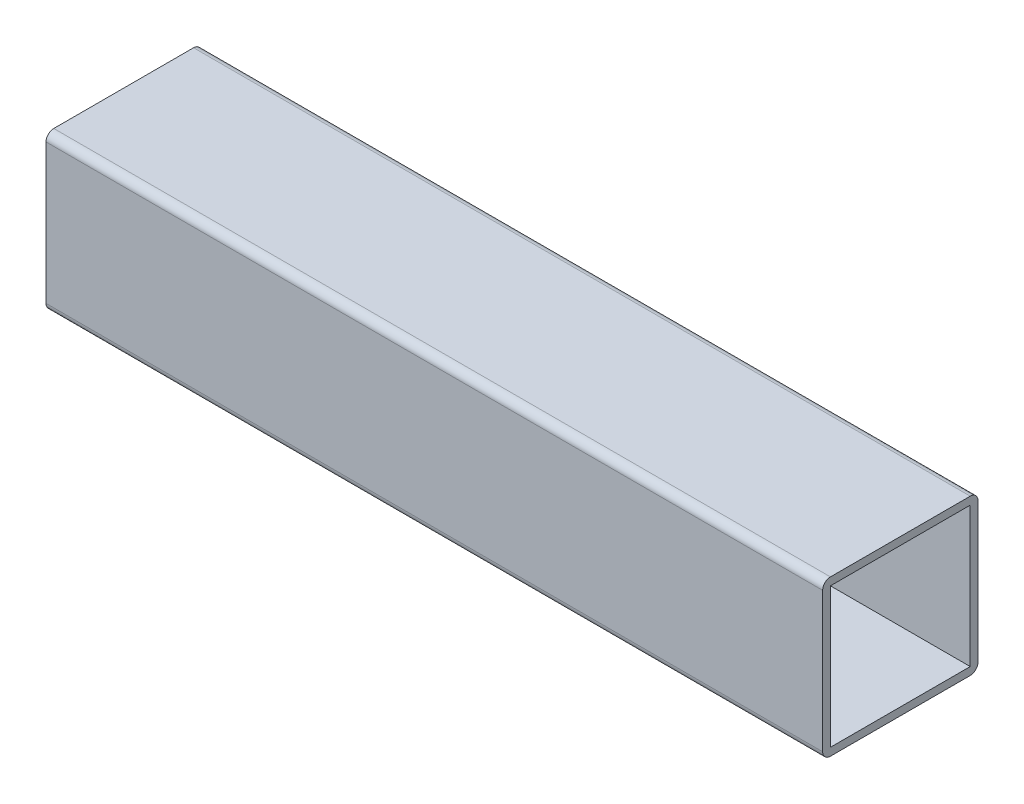
ISO-10303-21;
HEADER;
FILE_DESCRIPTION(('STEP AP214'),'2;1');
FILE_NAME('part.step','',(''),(''),'','','');
FILE_SCHEMA(('AUTOMOTIVE_DESIGN { 1 0 10303 214 1 1 1 1 }'));
ENDSEC;
DATA;
#1=APPLICATION_CONTEXT('core data for automotive mechanical design processes');
#2=APPLICATION_PROTOCOL_DEFINITION('international standard','automotive_design',2000,#1);
#3=PRODUCT_CONTEXT('',#1,'mechanical');
#4=PRODUCT('Part','Part','',(#3));
#5=PRODUCT_RELATED_PRODUCT_CATEGORY('part','',(#4));
#6=PRODUCT_DEFINITION_FORMATION('','',#4);
#7=PRODUCT_DEFINITION_CONTEXT('part definition',#1,'design');
#8=PRODUCT_DEFINITION('design','',#6,#7);
#9=PRODUCT_DEFINITION_SHAPE('','',#8);
#10=(LENGTH_UNIT() NAMED_UNIT(*) SI_UNIT(.MILLI.,.METRE.));
#11=(NAMED_UNIT(*) PLANE_ANGLE_UNIT() SI_UNIT($,.RADIAN.));
#12=(NAMED_UNIT(*) SI_UNIT($,.STERADIAN.) SOLID_ANGLE_UNIT());
#13=UNCERTAINTY_MEASURE_WITH_UNIT(LENGTH_MEASURE(1.E-05),#10,'distance_accuracy_value','');
#14=(GEOMETRIC_REPRESENTATION_CONTEXT(3) GLOBAL_UNCERTAINTY_ASSIGNED_CONTEXT((#13)) GLOBAL_UNIT_ASSIGNED_CONTEXT((#10,
#11,#12)) REPRESENTATION_CONTEXT('',''));
#15=CARTESIAN_POINT('',(0.,0.,0.));
#16=DIRECTION('',(0.,0.,1.));
#17=DIRECTION('',(1.,0.,0.));
#18=AXIS2_PLACEMENT_3D('',#15,#16,#17);
#19=CARTESIAN_POINT('',(300.,-27.,27.));
#20=DIRECTION('',(1.,0.,0.));
#21=DIRECTION('',(0.,0.,-1.));
#22=AXIS2_PLACEMENT_3D('',#19,#20,#21);
#23=PLANE('',#22);
#24=CARTESIAN_POINT('',(300.,-27.,27.));
#25=DIRECTION('',(1.,0.,0.));
#26=DIRECTION('',(0.,0.,-1.));
#27=AXIS2_PLACEMENT_3D('',#24,#25,#26);
#28=CIRCLE('',#27,3.);
#29=CARTESIAN_POINT('',(300.,-27.,30.));
#30=VERTEX_POINT('',#29);
#31=CARTESIAN_POINT('',(300.,-30.,27.));
#32=VERTEX_POINT('',#31);
#33=EDGE_CURVE('E213',#30,#32,#28,.T.);
#34=ORIENTED_EDGE('',*,*,#33,.T.);
#35=DIRECTION('',(0.,0.,-1.));
#36=VECTOR('',#35,1.);
#37=CARTESIAN_POINT('',(300.,-30.,27.));
#38=LINE('',#37,#36);
#39=CARTESIAN_POINT('',(300.,-30.,-27.));
#40=VERTEX_POINT('',#39);
#41=EDGE_CURVE('E217',#32,#40,#38,.T.);
#42=ORIENTED_EDGE('',*,*,#41,.T.);
#43=CARTESIAN_POINT('',(300.,-27.,-27.));
#44=DIRECTION('',(1.,0.,0.));
#45=DIRECTION('',(0.,0.,-1.));
#46=AXIS2_PLACEMENT_3D('',#43,#44,#45);
#47=CIRCLE('',#46,3.);
#48=CARTESIAN_POINT('',(300.,-27.,-30.));
#49=VERTEX_POINT('',#48);
#50=EDGE_CURVE('E221',#40,#49,#47,.T.);
#51=ORIENTED_EDGE('',*,*,#50,.T.);
#52=DIRECTION('',(0.,1.,0.));
#53=VECTOR('',#52,1.);
#54=CARTESIAN_POINT('',(300.,27.,-30.));
#55=LINE('',#54,#53);
#56=CARTESIAN_POINT('',(300.,27.,-30.));
#57=VERTEX_POINT('',#56);
#58=EDGE_CURVE('E224',#49,#57,#55,.T.);
#59=ORIENTED_EDGE('',*,*,#58,.T.);
#60=CARTESIAN_POINT('',(300.,27.,-27.));
#61=DIRECTION('',(1.,0.,0.));
#62=DIRECTION('',(0.,0.,1.));
#63=AXIS2_PLACEMENT_3D('',#60,#61,#62);
#64=CIRCLE('',#63,3.);
#65=CARTESIAN_POINT('',(300.,30.,-27.));
#66=VERTEX_POINT('',#65);
#67=EDGE_CURVE('E227',#57,#66,#64,.T.);
#68=ORIENTED_EDGE('',*,*,#67,.T.);
#69=DIRECTION('',(0.,0.,1.));
#70=VECTOR('',#69,1.);
#71=CARTESIAN_POINT('',(300.,30.,27.));
#72=LINE('',#71,#70);
#73=CARTESIAN_POINT('',(300.,30.,27.));
#74=VERTEX_POINT('',#73);
#75=EDGE_CURVE('E230',#66,#74,#72,.T.);
#76=ORIENTED_EDGE('',*,*,#75,.T.);
#77=CARTESIAN_POINT('',(300.,27.,27.));
#78=DIRECTION('',(1.,0.,0.));
#79=DIRECTION('',(0.,0.,-1.));
#80=AXIS2_PLACEMENT_3D('',#77,#78,#79);
#81=CIRCLE('',#80,3.);
#82=CARTESIAN_POINT('',(300.,27.,30.));
#83=VERTEX_POINT('',#82);
#84=EDGE_CURVE('E233',#74,#83,#81,.T.);
#85=ORIENTED_EDGE('',*,*,#84,.T.);
#86=DIRECTION('',(0.,-1.,0.));
#87=VECTOR('',#86,1.);
#88=CARTESIAN_POINT('',(300.,27.,30.));
#89=LINE('',#88,#87);
#90=EDGE_CURVE('E236',#83,#30,#89,.T.);
#91=ORIENTED_EDGE('',*,*,#90,.T.);
#92=EDGE_LOOP('',(#34,#42,#51,#59,#68,#76,#85,#91));
#93=FACE_BOUND('',#92,.T.);
#94=DIRECTION('',(0.,1.,0.));
#95=VECTOR('',#94,1.);
#96=CARTESIAN_POINT('',(300.,27.,-27.));
#97=LINE('',#96,#95);
#98=CARTESIAN_POINT('',(300.,-27.,-27.));
#99=VERTEX_POINT('',#98);
#100=CARTESIAN_POINT('',(300.,27.,-27.));
#101=VERTEX_POINT('',#100);
#102=EDGE_CURVE('E174',#99,#101,#97,.T.);
#103=ORIENTED_EDGE('',*,*,#102,.F.);
#104=DIRECTION('',(0.,0.,-1.));
#105=VECTOR('',#104,1.);
#106=CARTESIAN_POINT('',(300.,-27.,27.));
#107=LINE('',#106,#105);
#108=CARTESIAN_POINT('',(300.,-27.,27.));
#109=VERTEX_POINT('',#108);
#110=EDGE_CURVE('E165',#109,#99,#107,.T.);
#111=ORIENTED_EDGE('',*,*,#110,.F.);
#112=DIRECTION('',(0.,-1.,0.));
#113=VECTOR('',#112,1.);
#114=CARTESIAN_POINT('',(300.,27.,27.));
#115=LINE('',#114,#113);
#116=CARTESIAN_POINT('',(300.,27.,27.));
#117=VERTEX_POINT('',#116);
#118=EDGE_CURVE('E191',#117,#109,#115,.T.);
#119=ORIENTED_EDGE('',*,*,#118,.F.);
#120=DIRECTION('',(0.,0.,1.));
#121=VECTOR('',#120,1.);
#122=CARTESIAN_POINT('',(300.,27.,27.));
#123=LINE('',#122,#121);
#124=EDGE_CURVE('E187',#101,#117,#123,.T.);
#125=ORIENTED_EDGE('',*,*,#124,.F.);
#126=EDGE_LOOP('',(#103,#111,#119,#125));
#127=FACE_BOUND('',#126,.T.);
#128=ADVANCED_FACE('F75',(#93,#127),#23,.T.);
#129=CARTESIAN_POINT('',(0.,-27.,27.));
#130=DIRECTION('',(1.,0.,0.));
#131=DIRECTION('',(0.,0.,-1.));
#132=AXIS2_PLACEMENT_3D('',#129,#130,#131);
#133=PLANE('',#132);
#134=CARTESIAN_POINT('',(0.,-27.,27.));
#135=DIRECTION('',(1.,0.,0.));
#136=DIRECTION('',(0.,0.,-1.));
#137=AXIS2_PLACEMENT_3D('',#134,#135,#136);
#138=CIRCLE('',#137,3.);
#139=CARTESIAN_POINT('',(0.,-27.,30.));
#140=VERTEX_POINT('',#139);
#141=CARTESIAN_POINT('',(0.,-30.,27.));
#142=VERTEX_POINT('',#141);
#143=EDGE_CURVE('E183',#140,#142,#138,.T.);
#144=ORIENTED_EDGE('',*,*,#143,.F.);
#145=DIRECTION('',(0.,-1.,0.));
#146=VECTOR('',#145,1.);
#147=CARTESIAN_POINT('',(0.,27.,30.));
#148=LINE('',#147,#146);
#149=CARTESIAN_POINT('',(0.,27.,30.));
#150=VERTEX_POINT('',#149);
#151=EDGE_CURVE('E218',#150,#140,#148,.T.);
#152=ORIENTED_EDGE('',*,*,#151,.F.);
#153=CARTESIAN_POINT('',(0.,27.,27.));
#154=DIRECTION('',(1.,0.,0.));
#155=DIRECTION('',(0.,0.,-1.));
#156=AXIS2_PLACEMENT_3D('',#153,#154,#155);
#157=CIRCLE('',#156,3.);
#158=CARTESIAN_POINT('',(0.,30.,27.));
#159=VERTEX_POINT('',#158);
#160=EDGE_CURVE('E258',#159,#150,#157,.T.);
#161=ORIENTED_EDGE('',*,*,#160,.F.);
#162=DIRECTION('',(0.,0.,1.));
#163=VECTOR('',#162,1.);
#164=CARTESIAN_POINT('',(0.,30.,27.));
#165=LINE('',#164,#163);
#166=CARTESIAN_POINT('',(0.,30.,-27.));
#167=VERTEX_POINT('',#166);
#168=EDGE_CURVE('E255',#167,#159,#165,.T.);
#169=ORIENTED_EDGE('',*,*,#168,.F.);
#170=CARTESIAN_POINT('',(0.,27.,-27.));
#171=DIRECTION('',(1.,0.,0.));
#172=DIRECTION('',(0.,0.,1.));
#173=AXIS2_PLACEMENT_3D('',#170,#171,#172);
#174=CIRCLE('',#173,3.);
#175=CARTESIAN_POINT('',(0.,27.,-30.));
#176=VERTEX_POINT('',#175);
#177=EDGE_CURVE('E252',#176,#167,#174,.T.);
#178=ORIENTED_EDGE('',*,*,#177,.F.);
#179=DIRECTION('',(0.,1.,0.));
#180=VECTOR('',#179,1.);
#181=CARTESIAN_POINT('',(0.,27.,-30.));
#182=LINE('',#181,#180);
#183=CARTESIAN_POINT('',(0.,-27.,-30.));
#184=VERTEX_POINT('',#183);
#185=EDGE_CURVE('E249',#184,#176,#182,.T.);
#186=ORIENTED_EDGE('',*,*,#185,.F.);
#187=CARTESIAN_POINT('',(0.,-27.,-27.));
#188=DIRECTION('',(1.,0.,0.));
#189=DIRECTION('',(0.,0.,-1.));
#190=AXIS2_PLACEMENT_3D('',#187,#188,#189);
#191=CIRCLE('',#190,3.);
#192=CARTESIAN_POINT('',(0.,-30.,-27.));
#193=VERTEX_POINT('',#192);
#194=EDGE_CURVE('E246',#193,#184,#191,.T.);
#195=ORIENTED_EDGE('',*,*,#194,.F.);
#196=DIRECTION('',(0.,0.,-1.));
#197=VECTOR('',#196,1.);
#198=CARTESIAN_POINT('',(0.,-30.,27.));
#199=LINE('',#198,#197);
#200=EDGE_CURVE('E243',#142,#193,#199,.T.);
#201=ORIENTED_EDGE('',*,*,#200,.F.);
#202=EDGE_LOOP('',(#144,#152,#161,#169,#178,#186,#195,#201));
#203=FACE_BOUND('',#202,.T.);
#204=DIRECTION('',(0.,0.,-1.));
#205=VECTOR('',#204,1.);
#206=CARTESIAN_POINT('',(0.,-27.,27.));
#207=LINE('',#206,#205);
#208=CARTESIAN_POINT('',(0.,-27.,27.));
#209=VERTEX_POINT('',#208);
#210=CARTESIAN_POINT('',(0.,-27.,-27.));
#211=VERTEX_POINT('',#210);
#212=EDGE_CURVE('E99',#209,#211,#207,.T.);
#213=ORIENTED_EDGE('',*,*,#212,.T.);
#214=DIRECTION('',(0.,1.,0.));
#215=VECTOR('',#214,1.);
#216=CARTESIAN_POINT('',(0.,27.,-27.));
#217=LINE('',#216,#215);
#218=CARTESIAN_POINT('',(0.,27.,-27.));
#219=VERTEX_POINT('',#218);
#220=EDGE_CURVE('E181',#211,#219,#217,.T.);
#221=ORIENTED_EDGE('',*,*,#220,.T.);
#222=DIRECTION('',(0.,0.,1.));
#223=VECTOR('',#222,1.);
#224=CARTESIAN_POINT('',(0.,27.,27.));
#225=LINE('',#224,#223);
#226=CARTESIAN_POINT('',(0.,27.,27.));
#227=VERTEX_POINT('',#226);
#228=EDGE_CURVE('E200',#219,#227,#225,.T.);
#229=ORIENTED_EDGE('',*,*,#228,.T.);
#230=DIRECTION('',(0.,-1.,0.));
#231=VECTOR('',#230,1.);
#232=CARTESIAN_POINT('',(0.,27.,27.));
#233=LINE('',#232,#231);
#234=EDGE_CURVE('E175',#227,#209,#233,.T.);
#235=ORIENTED_EDGE('',*,*,#234,.T.);
#236=EDGE_LOOP('',(#213,#221,#229,#235));
#237=FACE_BOUND('',#236,.T.);
#238=ADVANCED_FACE('F297',(#203,#237),#133,.F.);
#239=CARTESIAN_POINT('',(300.,-27.,27.));
#240=DIRECTION('',(-1.,0.,0.));
#241=DIRECTION('',(0.,0.,1.));
#242=AXIS2_PLACEMENT_3D('',#239,#240,#241);
#243=CYLINDRICAL_SURFACE('',#242,3.);
#244=ORIENTED_EDGE('',*,*,#143,.T.);
#245=DIRECTION('',(-1.,0.,0.));
#246=VECTOR('',#245,1.);
#247=CARTESIAN_POINT('',(300.,-30.,27.));
#248=LINE('',#247,#246);
#249=EDGE_CURVE('E12',#32,#142,#248,.T.);
#250=ORIENTED_EDGE('',*,*,#249,.F.);
#251=ORIENTED_EDGE('',*,*,#33,.F.);
#252=DIRECTION('',(-1.,0.,0.));
#253=VECTOR('',#252,1.);
#254=CARTESIAN_POINT('',(300.,-27.,30.));
#255=LINE('',#254,#253);
#256=EDGE_CURVE('E239',#30,#140,#255,.T.);
#257=ORIENTED_EDGE('',*,*,#256,.T.);
#258=EDGE_LOOP('',(#244,#250,#251,#257));
#259=FACE_BOUND('',#258,.T.);
#260=ADVANCED_FACE('F77',(#259),#243,.T.);
#261=CARTESIAN_POINT('',(300.,-30.,27.));
#262=DIRECTION('',(0.,1.,0.));
#263=DIRECTION('',(0.,0.,1.));
#264=AXIS2_PLACEMENT_3D('',#261,#262,#263);
#265=PLANE('',#264);
#266=ORIENTED_EDGE('',*,*,#200,.T.);
#267=DIRECTION('',(-1.,0.,0.));
#268=VECTOR('',#267,1.);
#269=CARTESIAN_POINT('',(300.,-30.,-27.));
#270=LINE('',#269,#268);
#271=EDGE_CURVE('E84',#40,#193,#270,.T.);
#272=ORIENTED_EDGE('',*,*,#271,.F.);
#273=ORIENTED_EDGE('',*,*,#41,.F.);
#274=ORIENTED_EDGE('',*,*,#249,.T.);
#275=EDGE_LOOP('',(#266,#272,#273,#274));
#276=FACE_BOUND('',#275,.T.);
#277=ADVANCED_FACE('F314',(#276),#265,.F.);
#278=CARTESIAN_POINT('',(300.,-27.,-27.));
#279=DIRECTION('',(-1.,0.,0.));
#280=DIRECTION('',(0.,0.,1.));
#281=AXIS2_PLACEMENT_3D('',#278,#279,#280);
#282=CYLINDRICAL_SURFACE('',#281,3.);
#283=ORIENTED_EDGE('',*,*,#194,.T.);
#284=DIRECTION('',(-1.,0.,0.));
#285=VECTOR('',#284,1.);
#286=CARTESIAN_POINT('',(300.,-27.,-30.));
#287=LINE('',#286,#285);
#288=EDGE_CURVE('E282',#49,#184,#287,.T.);
#289=ORIENTED_EDGE('',*,*,#288,.F.);
#290=ORIENTED_EDGE('',*,*,#50,.F.);
#291=ORIENTED_EDGE('',*,*,#271,.T.);
#292=EDGE_LOOP('',(#283,#289,#290,#291));
#293=FACE_BOUND('',#292,.T.);
#294=ADVANCED_FACE('F291',(#293),#282,.T.);
#295=CARTESIAN_POINT('',(300.,27.,-30.));
#296=DIRECTION('',(0.,0.,1.));
#297=DIRECTION('',(0.,-1.,0.));
#298=AXIS2_PLACEMENT_3D('',#295,#296,#297);
#299=PLANE('',#298);
#300=ORIENTED_EDGE('',*,*,#185,.T.);
#301=DIRECTION('',(-1.,0.,0.));
#302=VECTOR('',#301,1.);
#303=CARTESIAN_POINT('',(300.,27.,-30.));
#304=LINE('',#303,#302);
#305=EDGE_CURVE('E278',#57,#176,#304,.T.);
#306=ORIENTED_EDGE('',*,*,#305,.F.);
#307=ORIENTED_EDGE('',*,*,#58,.F.);
#308=ORIENTED_EDGE('',*,*,#288,.T.);
#309=EDGE_LOOP('',(#300,#306,#307,#308));
#310=FACE_BOUND('',#309,.T.);
#311=ADVANCED_FACE('F303',(#310),#299,.F.);
#312=CARTESIAN_POINT('',(300.,27.,-27.));
#313=DIRECTION('',(-1.,0.,0.));
#314=DIRECTION('',(0.,0.,1.));
#315=AXIS2_PLACEMENT_3D('',#312,#313,#314);
#316=CYLINDRICAL_SURFACE('',#315,3.);
#317=ORIENTED_EDGE('',*,*,#177,.T.);
#318=DIRECTION('',(-1.,0.,0.));
#319=VECTOR('',#318,1.);
#320=CARTESIAN_POINT('',(300.,30.,-27.));
#321=LINE('',#320,#319);
#322=EDGE_CURVE('E274',#66,#167,#321,.T.);
#323=ORIENTED_EDGE('',*,*,#322,.F.);
#324=ORIENTED_EDGE('',*,*,#67,.F.);
#325=ORIENTED_EDGE('',*,*,#305,.T.);
#326=EDGE_LOOP('',(#317,#323,#324,#325));
#327=FACE_BOUND('',#326,.T.);
#328=ADVANCED_FACE('F307',(#327),#316,.T.);
#329=CARTESIAN_POINT('',(300.,30.,27.));
#330=DIRECTION('',(0.,-1.,0.));
#331=DIRECTION('',(0.,0.,-1.));
#332=AXIS2_PLACEMENT_3D('',#329,#330,#331);
#333=PLANE('',#332);
#334=ORIENTED_EDGE('',*,*,#168,.T.);
#335=DIRECTION('',(-1.,0.,0.));
#336=VECTOR('',#335,1.);
#337=CARTESIAN_POINT('',(300.,30.,27.));
#338=LINE('',#337,#336);
#339=EDGE_CURVE('E270',#74,#159,#338,.T.);
#340=ORIENTED_EDGE('',*,*,#339,.F.);
#341=ORIENTED_EDGE('',*,*,#75,.F.);
#342=ORIENTED_EDGE('',*,*,#322,.T.);
#343=EDGE_LOOP('',(#334,#340,#341,#342));
#344=FACE_BOUND('',#343,.T.);
#345=ADVANCED_FACE('F327',(#344),#333,.F.);
#346=CARTESIAN_POINT('',(300.,27.,27.));
#347=DIRECTION('',(-1.,0.,0.));
#348=DIRECTION('',(0.,0.,1.));
#349=AXIS2_PLACEMENT_3D('',#346,#347,#348);
#350=CYLINDRICAL_SURFACE('',#349,3.);
#351=ORIENTED_EDGE('',*,*,#160,.T.);
#352=DIRECTION('',(-1.,0.,0.));
#353=VECTOR('',#352,1.);
#354=CARTESIAN_POINT('',(300.,27.,30.));
#355=LINE('',#354,#353);
#356=EDGE_CURVE('E266',#83,#150,#355,.T.);
#357=ORIENTED_EDGE('',*,*,#356,.F.);
#358=ORIENTED_EDGE('',*,*,#84,.F.);
#359=ORIENTED_EDGE('',*,*,#339,.T.);
#360=EDGE_LOOP('',(#351,#357,#358,#359));
#361=FACE_BOUND('',#360,.T.);
#362=ADVANCED_FACE('F325',(#361),#350,.T.);
#363=CARTESIAN_POINT('',(300.,27.,30.));
#364=DIRECTION('',(0.,0.,-1.));
#365=DIRECTION('',(-1.,0.,0.));
#366=AXIS2_PLACEMENT_3D('',#363,#364,#365);
#367=PLANE('',#366);
#368=ORIENTED_EDGE('',*,*,#151,.T.);
#369=ORIENTED_EDGE('',*,*,#256,.F.);
#370=ORIENTED_EDGE('',*,*,#90,.F.);
#371=ORIENTED_EDGE('',*,*,#356,.T.);
#372=EDGE_LOOP('',(#368,#369,#370,#371));
#373=FACE_BOUND('',#372,.T.);
#374=ADVANCED_FACE('F320',(#373),#367,.F.);
#375=CARTESIAN_POINT('',(300.,-27.,27.));
#376=DIRECTION('',(0.,1.,0.));
#377=DIRECTION('',(0.,0.,1.));
#378=AXIS2_PLACEMENT_3D('',#375,#376,#377);
#379=PLANE('',#378);
#380=ORIENTED_EDGE('',*,*,#212,.F.);
#381=DIRECTION('',(-1.,0.,0.));
#382=VECTOR('',#381,1.);
#383=CARTESIAN_POINT('',(300.,-27.,27.));
#384=LINE('',#383,#382);
#385=EDGE_CURVE('E169',#109,#209,#384,.T.);
#386=ORIENTED_EDGE('',*,*,#385,.F.);
#387=ORIENTED_EDGE('',*,*,#110,.T.);
#388=DIRECTION('',(-1.,0.,0.));
#389=VECTOR('',#388,1.);
#390=CARTESIAN_POINT('',(300.,-27.,-27.));
#391=LINE('',#390,#389);
#392=EDGE_CURVE('E168',#99,#211,#391,.T.);
#393=ORIENTED_EDGE('',*,*,#392,.T.);
#394=EDGE_LOOP('',(#380,#386,#387,#393));
#395=FACE_BOUND('',#394,.T.);
#396=ADVANCED_FACE('F167',(#395),#379,.T.);
#397=CARTESIAN_POINT('',(300.,27.,-27.));
#398=DIRECTION('',(0.,0.,1.));
#399=DIRECTION('',(0.,-1.,0.));
#400=AXIS2_PLACEMENT_3D('',#397,#398,#399);
#401=PLANE('',#400);
#402=ORIENTED_EDGE('',*,*,#220,.F.);
#403=ORIENTED_EDGE('',*,*,#392,.F.);
#404=ORIENTED_EDGE('',*,*,#102,.T.);
#405=DIRECTION('',(-1.,0.,0.));
#406=VECTOR('',#405,1.);
#407=CARTESIAN_POINT('',(300.,27.,-27.));
#408=LINE('',#407,#406);
#409=EDGE_CURVE('E184',#101,#219,#408,.T.);
#410=ORIENTED_EDGE('',*,*,#409,.T.);
#411=EDGE_LOOP('',(#402,#403,#404,#410));
#412=FACE_BOUND('',#411,.T.);
#413=ADVANCED_FACE('F178',(#412),#401,.T.);
#414=CARTESIAN_POINT('',(300.,27.,27.));
#415=DIRECTION('',(0.,-1.,0.));
#416=DIRECTION('',(0.,0.,-1.));
#417=AXIS2_PLACEMENT_3D('',#414,#415,#416);
#418=PLANE('',#417);
#419=ORIENTED_EDGE('',*,*,#228,.F.);
#420=ORIENTED_EDGE('',*,*,#409,.F.);
#421=ORIENTED_EDGE('',*,*,#124,.T.);
#422=DIRECTION('',(-1.,0.,0.));
#423=VECTOR('',#422,1.);
#424=CARTESIAN_POINT('',(300.,27.,27.));
#425=LINE('',#424,#423);
#426=EDGE_CURVE('E91',#117,#227,#425,.T.);
#427=ORIENTED_EDGE('',*,*,#426,.T.);
#428=EDGE_LOOP('',(#419,#420,#421,#427));
#429=FACE_BOUND('',#428,.T.);
#430=ADVANCED_FACE('F352',(#429),#418,.T.);
#431=CARTESIAN_POINT('',(300.,27.,27.));
#432=DIRECTION('',(0.,0.,-1.));
#433=DIRECTION('',(-1.,0.,0.));
#434=AXIS2_PLACEMENT_3D('',#431,#432,#433);
#435=PLANE('',#434);
#436=ORIENTED_EDGE('',*,*,#234,.F.);
#437=ORIENTED_EDGE('',*,*,#426,.F.);
#438=ORIENTED_EDGE('',*,*,#118,.T.);
#439=ORIENTED_EDGE('',*,*,#385,.T.);
#440=EDGE_LOOP('',(#436,#437,#438,#439));
#441=FACE_BOUND('',#440,.T.);
#442=ADVANCED_FACE('F356',(#441),#435,.T.);
#443=CLOSED_SHELL('',(#128,#238,#260,#277,#294,#311,#328,#345,#362,#374,#396,#413,#430,#442));
#444=MANIFOLD_SOLID_BREP('B2',#443);
#445=ADVANCED_BREP_SHAPE_REPRESENTATION('',(#18,#444),#14);
#446=SHAPE_DEFINITION_REPRESENTATION(#9,#445);
ENDSEC;
END-ISO-10303-21;
